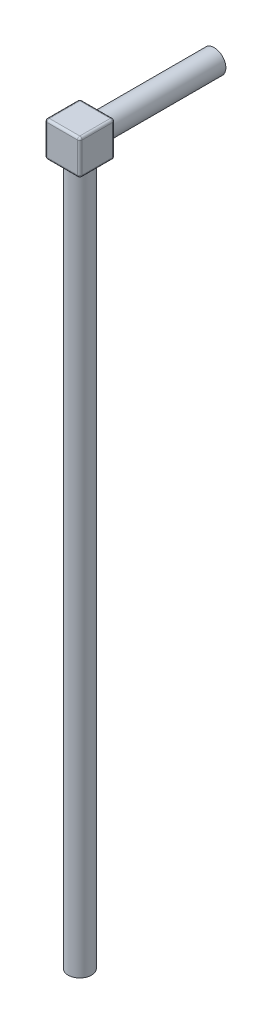
ISO-10303-21;
HEADER;
FILE_DESCRIPTION(('STEP AP214'),'2;1');
FILE_NAME('part.step','',(''),(''),'','','');
FILE_SCHEMA(('AUTOMOTIVE_DESIGN { 1 0 10303 214 1 1 1 1 }'));
ENDSEC;
DATA;
#1=APPLICATION_CONTEXT('core data for automotive mechanical design processes');
#2=APPLICATION_PROTOCOL_DEFINITION('international standard','automotive_design',2000,#1);
#3=PRODUCT_CONTEXT('',#1,'mechanical');
#4=PRODUCT('Part','Part','',(#3));
#5=PRODUCT_RELATED_PRODUCT_CATEGORY('part','',(#4));
#6=PRODUCT_DEFINITION_FORMATION('','',#4);
#7=PRODUCT_DEFINITION_CONTEXT('part definition',#1,'design');
#8=PRODUCT_DEFINITION('design','',#6,#7);
#9=PRODUCT_DEFINITION_SHAPE('','',#8);
#10=(LENGTH_UNIT() NAMED_UNIT(*) SI_UNIT(.MILLI.,.METRE.));
#11=(NAMED_UNIT(*) PLANE_ANGLE_UNIT() SI_UNIT($,.RADIAN.));
#12=(NAMED_UNIT(*) SI_UNIT($,.STERADIAN.) SOLID_ANGLE_UNIT());
#13=UNCERTAINTY_MEASURE_WITH_UNIT(LENGTH_MEASURE(1.E-05),#10,'distance_accuracy_value','');
#14=(GEOMETRIC_REPRESENTATION_CONTEXT(3) GLOBAL_UNCERTAINTY_ASSIGNED_CONTEXT((#13)) GLOBAL_UNIT_ASSIGNED_CONTEXT((#10,
#11,#12)) REPRESENTATION_CONTEXT('',''));
#15=CARTESIAN_POINT('',(0.,0.,0.));
#16=DIRECTION('',(0.,0.,1.));
#17=DIRECTION('',(1.,0.,0.));
#18=AXIS2_PLACEMENT_3D('',#15,#16,#17);
#19=CARTESIAN_POINT('',(7.5,7.5,-7.5));
#20=DIRECTION('',(-1.,0.,0.));
#21=DIRECTION('',(0.,0.,1.));
#22=AXIS2_PLACEMENT_3D('',#19,#20,#21);
#23=PLANE('',#22);
#24=DIRECTION('',(0.,0.,-1.));
#25=VECTOR('',#24,1.);
#26=CARTESIAN_POINT('',(7.5,6.5,7.5));
#27=LINE('',#26,#25);
#28=CARTESIAN_POINT('',(7.5,6.5,-6.5));
#29=VERTEX_POINT('',#28);
#30=CARTESIAN_POINT('',(7.5,6.5,6.5));
#31=VERTEX_POINT('',#30);
#32=EDGE_CURVE('E44',#29,#31,#27,.F.);
#33=ORIENTED_EDGE('',*,*,#32,.T.);
#34=DIRECTION('',(0.,-1.,0.));
#35=VECTOR('',#34,1.);
#36=CARTESIAN_POINT('',(7.5,7.5,6.5));
#37=LINE('',#36,#35);
#38=CARTESIAN_POINT('',(7.5,-6.5,6.5));
#39=VERTEX_POINT('',#38);
#40=EDGE_CURVE('E11',#31,#39,#37,.T.);
#41=ORIENTED_EDGE('',*,*,#40,.T.);
#42=DIRECTION('',(0.,0.,-1.));
#43=VECTOR('',#42,1.);
#44=CARTESIAN_POINT('',(7.5,-6.5,-7.5));
#45=LINE('',#44,#43);
#46=CARTESIAN_POINT('',(7.5,-6.5,-6.5));
#47=VERTEX_POINT('',#46);
#48=EDGE_CURVE('E210',#39,#47,#45,.T.);
#49=ORIENTED_EDGE('',*,*,#48,.T.);
#50=DIRECTION('',(0.,-1.,0.));
#51=VECTOR('',#50,1.);
#52=CARTESIAN_POINT('',(7.5,7.5,-6.5));
#53=LINE('',#52,#51);
#54=EDGE_CURVE('E55',#47,#29,#53,.F.);
#55=ORIENTED_EDGE('',*,*,#54,.T.);
#56=EDGE_LOOP('',(#33,#41,#49,#55));
#57=FACE_BOUND('',#56,.T.);
#58=ADVANCED_FACE('F35',(#57),#23,.F.);
#59=CARTESIAN_POINT('',(-7.5,7.5,-7.5));
#60=DIRECTION('',(0.,0.,1.));
#61=DIRECTION('',(1.,0.,0.));
#62=AXIS2_PLACEMENT_3D('',#59,#60,#61);
#63=PLANE('',#62);
#64=DIRECTION('',(0.,-1.,0.));
#65=VECTOR('',#64,1.);
#66=CARTESIAN_POINT('',(6.5,7.5,-7.5));
#67=LINE('',#66,#65);
#68=CARTESIAN_POINT('',(6.5,6.5,-7.5));
#69=VERTEX_POINT('',#68);
#70=CARTESIAN_POINT('',(6.5,-6.5,-7.5));
#71=VERTEX_POINT('',#70);
#72=EDGE_CURVE('E128',#69,#71,#67,.T.);
#73=ORIENTED_EDGE('',*,*,#72,.T.);
#74=DIRECTION('',(-1.,0.,0.));
#75=VECTOR('',#74,1.);
#76=CARTESIAN_POINT('',(-7.5,-6.5,-7.5));
#77=LINE('',#76,#75);
#78=CARTESIAN_POINT('',(-6.5,-6.5,-7.5));
#79=VERTEX_POINT('',#78);
#80=EDGE_CURVE('E167',#71,#79,#77,.T.);
#81=ORIENTED_EDGE('',*,*,#80,.T.);
#82=DIRECTION('',(0.,-1.,0.));
#83=VECTOR('',#82,1.);
#84=CARTESIAN_POINT('',(-6.5,7.5,-7.5));
#85=LINE('',#84,#83);
#86=CARTESIAN_POINT('',(-6.5,6.5,-7.5));
#87=VERTEX_POINT('',#86);
#88=EDGE_CURVE('E131',#79,#87,#85,.F.);
#89=ORIENTED_EDGE('',*,*,#88,.T.);
#90=DIRECTION('',(-1.,0.,0.));
#91=VECTOR('',#90,1.);
#92=CARTESIAN_POINT('',(7.5,6.5,-7.5));
#93=LINE('',#92,#91);
#94=EDGE_CURVE('E122',#87,#69,#93,.F.);
#95=ORIENTED_EDGE('',*,*,#94,.T.);
#96=EDGE_LOOP('',(#73,#81,#89,#95));
#97=FACE_BOUND('',#96,.T.);
#98=CARTESIAN_POINT('',(0.,0.,-7.5));
#99=DIRECTION('',(0.,0.,1.));
#100=DIRECTION('',(1.,0.,0.));
#101=AXIS2_PLACEMENT_3D('',#98,#99,#100);
#102=CIRCLE('',#101,5.);
#103=CARTESIAN_POINT('',(5.,0.,-7.5));
#104=VERTEX_POINT('',#103);
#105=EDGE_CURVE('E159',#104,#104,#102,.F.);
#106=ORIENTED_EDGE('',*,*,#105,.F.);
#107=EDGE_LOOP('',(#106));
#108=FACE_BOUND('',#107,.T.);
#109=ADVANCED_FACE('F124',(#97,#108),#63,.F.);
#110=CARTESIAN_POINT('',(-7.5,7.5,-7.5));
#111=DIRECTION('',(1.,0.,0.));
#112=DIRECTION('',(0.,0.,-1.));
#113=AXIS2_PLACEMENT_3D('',#110,#111,#112);
#114=PLANE('',#113);
#115=DIRECTION('',(0.,-1.,0.));
#116=VECTOR('',#115,1.);
#117=CARTESIAN_POINT('',(-7.5,7.5,-6.5));
#118=LINE('',#117,#116);
#119=CARTESIAN_POINT('',(-7.5,6.5,-6.5));
#120=VERTEX_POINT('',#119);
#121=CARTESIAN_POINT('',(-7.5,-6.5,-6.5));
#122=VERTEX_POINT('',#121);
#123=EDGE_CURVE('E197',#120,#122,#118,.T.);
#124=ORIENTED_EDGE('',*,*,#123,.T.);
#125=DIRECTION('',(0.,0.,1.));
#126=VECTOR('',#125,1.);
#127=CARTESIAN_POINT('',(-7.5,-6.5,-7.5));
#128=LINE('',#127,#126);
#129=CARTESIAN_POINT('',(-7.5,-6.5,6.5));
#130=VERTEX_POINT('',#129);
#131=EDGE_CURVE('E200',#122,#130,#128,.T.);
#132=ORIENTED_EDGE('',*,*,#131,.T.);
#133=DIRECTION('',(0.,-1.,0.));
#134=VECTOR('',#133,1.);
#135=CARTESIAN_POINT('',(-7.5,7.5,6.5));
#136=LINE('',#135,#134);
#137=CARTESIAN_POINT('',(-7.5,6.5,6.5));
#138=VERTEX_POINT('',#137);
#139=EDGE_CURVE('E195',#130,#138,#136,.F.);
#140=ORIENTED_EDGE('',*,*,#139,.T.);
#141=DIRECTION('',(0.,0.,1.));
#142=VECTOR('',#141,1.);
#143=CARTESIAN_POINT('',(-7.5,6.5,-7.5));
#144=LINE('',#143,#142);
#145=EDGE_CURVE('E193',#138,#120,#144,.F.);
#146=ORIENTED_EDGE('',*,*,#145,.T.);
#147=EDGE_LOOP('',(#124,#132,#140,#146));
#148=FACE_BOUND('',#147,.T.);
#149=ADVANCED_FACE('F288',(#148),#114,.F.);
#150=CARTESIAN_POINT('',(-7.5,7.5,7.5));
#151=DIRECTION('',(0.,0.,-1.));
#152=DIRECTION('',(-1.,0.,0.));
#153=AXIS2_PLACEMENT_3D('',#150,#151,#152);
#154=PLANE('',#153);
#155=DIRECTION('',(0.,-1.,0.));
#156=VECTOR('',#155,1.);
#157=CARTESIAN_POINT('',(-6.5,7.5,7.5));
#158=LINE('',#157,#156);
#159=CARTESIAN_POINT('',(-6.5,6.5,7.5));
#160=VERTEX_POINT('',#159);
#161=CARTESIAN_POINT('',(-6.5,-6.5,7.5));
#162=VERTEX_POINT('',#161);
#163=EDGE_CURVE('E185',#160,#162,#158,.T.);
#164=ORIENTED_EDGE('',*,*,#163,.T.);
#165=DIRECTION('',(1.,0.,0.));
#166=VECTOR('',#165,1.);
#167=CARTESIAN_POINT('',(-7.5,-6.5,7.5));
#168=LINE('',#167,#166);
#169=CARTESIAN_POINT('',(6.5,-6.5,7.5));
#170=VERTEX_POINT('',#169);
#171=EDGE_CURVE('E187',#162,#170,#168,.T.);
#172=ORIENTED_EDGE('',*,*,#171,.T.);
#173=DIRECTION('',(0.,-1.,0.));
#174=VECTOR('',#173,1.);
#175=CARTESIAN_POINT('',(6.5,7.5,7.5));
#176=LINE('',#175,#174);
#177=CARTESIAN_POINT('',(6.5,6.5,7.5));
#178=VERTEX_POINT('',#177);
#179=EDGE_CURVE('E181',#170,#178,#176,.F.);
#180=ORIENTED_EDGE('',*,*,#179,.T.);
#181=DIRECTION('',(1.,0.,0.));
#182=VECTOR('',#181,1.);
#183=CARTESIAN_POINT('',(-7.5,6.5,7.5));
#184=LINE('',#183,#182);
#185=EDGE_CURVE('E183',#178,#160,#184,.F.);
#186=ORIENTED_EDGE('',*,*,#185,.T.);
#187=EDGE_LOOP('',(#164,#172,#180,#186));
#188=FACE_BOUND('',#187,.T.);
#189=ADVANCED_FACE('F294',(#188),#154,.F.);
#190=CARTESIAN_POINT('',(0.,7.5,0.));
#191=DIRECTION('',(0.,1.,0.));
#192=DIRECTION('',(0.,0.,1.));
#193=AXIS2_PLACEMENT_3D('',#190,#191,#192);
#194=PLANE('',#193);
#195=DIRECTION('',(0.,0.,1.));
#196=VECTOR('',#195,1.);
#197=CARTESIAN_POINT('',(-6.5,7.5,7.5));
#198=LINE('',#197,#196);
#199=CARTESIAN_POINT('',(-6.5,7.5,-6.5));
#200=VERTEX_POINT('',#199);
#201=CARTESIAN_POINT('',(-6.5,7.5,6.5));
#202=VERTEX_POINT('',#201);
#203=EDGE_CURVE('E205',#200,#202,#198,.T.);
#204=ORIENTED_EDGE('',*,*,#203,.T.);
#205=DIRECTION('',(1.,0.,0.));
#206=VECTOR('',#205,1.);
#207=CARTESIAN_POINT('',(7.5,7.5,6.5));
#208=LINE('',#207,#206);
#209=CARTESIAN_POINT('',(6.5,7.5,6.5));
#210=VERTEX_POINT('',#209);
#211=EDGE_CURVE('E207',#202,#210,#208,.T.);
#212=ORIENTED_EDGE('',*,*,#211,.T.);
#213=DIRECTION('',(0.,0.,-1.));
#214=VECTOR('',#213,1.);
#215=CARTESIAN_POINT('',(6.5,7.5,-7.5));
#216=LINE('',#215,#214);
#217=CARTESIAN_POINT('',(6.5,7.5,-6.5));
#218=VERTEX_POINT('',#217);
#219=EDGE_CURVE('E202',#210,#218,#216,.T.);
#220=ORIENTED_EDGE('',*,*,#219,.T.);
#221=DIRECTION('',(-1.,0.,0.));
#222=VECTOR('',#221,1.);
#223=CARTESIAN_POINT('',(-7.5,7.5,-6.5));
#224=LINE('',#223,#222);
#225=EDGE_CURVE('E141',#218,#200,#224,.T.);
#226=ORIENTED_EDGE('',*,*,#225,.T.);
#227=EDGE_LOOP('',(#204,#212,#220,#226));
#228=FACE_BOUND('',#227,.T.);
#229=ADVANCED_FACE('F379',(#228),#194,.T.);
#230=CARTESIAN_POINT('',(0.,-7.5,0.));
#231=DIRECTION('',(0.,1.,0.));
#232=DIRECTION('',(0.,0.,1.));
#233=AXIS2_PLACEMENT_3D('',#230,#231,#232);
#234=PLANE('',#233);
#235=CARTESIAN_POINT('',(0.,-7.5,0.));
#236=DIRECTION('',(0.,1.,0.));
#237=DIRECTION('',(0.,0.,1.));
#238=AXIS2_PLACEMENT_3D('',#235,#236,#237);
#239=CIRCLE('',#238,6.);
#240=CARTESIAN_POINT('',(0.,-7.5,6.));
#241=VERTEX_POINT('',#240);
#242=EDGE_CURVE('E178',#241,#241,#239,.T.);
#243=ORIENTED_EDGE('',*,*,#242,.T.);
#244=EDGE_LOOP('',(#243));
#245=FACE_BOUND('',#244,.T.);
#246=DIRECTION('',(1.,0.,0.));
#247=VECTOR('',#246,1.);
#248=CARTESIAN_POINT('',(0.,-7.5,6.5));
#249=LINE('',#248,#247);
#250=CARTESIAN_POINT('',(6.5,-7.5,6.5));
#251=VERTEX_POINT('',#250);
#252=CARTESIAN_POINT('',(-6.5,-7.5,6.5));
#253=VERTEX_POINT('',#252);
#254=EDGE_CURVE('E171',#251,#253,#249,.F.);
#255=ORIENTED_EDGE('',*,*,#254,.T.);
#256=DIRECTION('',(0.,0.,1.));
#257=VECTOR('',#256,1.);
#258=CARTESIAN_POINT('',(-6.5,-7.5,0.));
#259=LINE('',#258,#257);
#260=CARTESIAN_POINT('',(-6.5,-7.5,-6.5));
#261=VERTEX_POINT('',#260);
#262=EDGE_CURVE('E176',#253,#261,#259,.F.);
#263=ORIENTED_EDGE('',*,*,#262,.T.);
#264=DIRECTION('',(-1.,0.,0.));
#265=VECTOR('',#264,1.);
#266=CARTESIAN_POINT('',(0.,-7.5,-6.5));
#267=LINE('',#266,#265);
#268=CARTESIAN_POINT('',(6.5,-7.5,-6.5));
#269=VERTEX_POINT('',#268);
#270=EDGE_CURVE('E173',#261,#269,#267,.F.);
#271=ORIENTED_EDGE('',*,*,#270,.T.);
#272=DIRECTION('',(0.,0.,-1.));
#273=VECTOR('',#272,1.);
#274=CARTESIAN_POINT('',(6.5,-7.5,0.));
#275=LINE('',#274,#273);
#276=EDGE_CURVE('E169',#269,#251,#275,.F.);
#277=ORIENTED_EDGE('',*,*,#276,.T.);
#278=EDGE_LOOP('',(#255,#263,#271,#277));
#279=FACE_BOUND('',#278,.T.);
#280=ADVANCED_FACE('F284',(#245,#279),#234,.F.);
#281=CARTESIAN_POINT('',(0.,0.,-57.5));
#282=DIRECTION('',(0.,0.,1.));
#283=DIRECTION('',(1.,0.,0.));
#284=AXIS2_PLACEMENT_3D('',#281,#282,#283);
#285=CYLINDRICAL_SURFACE('',#284,5.);
#286=CARTESIAN_POINT('',(0.,0.,-57.5));
#287=DIRECTION('',(0.,0.,-1.));
#288=DIRECTION('',(-1.,0.,0.));
#289=AXIS2_PLACEMENT_3D('',#286,#287,#288);
#290=CIRCLE('',#289,5.);
#291=CARTESIAN_POINT('',(-5.,0.,-57.5));
#292=VERTEX_POINT('',#291);
#293=EDGE_CURVE('E162',#292,#292,#290,.T.);
#294=ORIENTED_EDGE('',*,*,#293,.F.);
#295=EDGE_LOOP('',(#294));
#296=FACE_BOUND('',#295,.T.);
#297=ORIENTED_EDGE('',*,*,#105,.T.);
#298=EDGE_LOOP('',(#297));
#299=FACE_BOUND('',#298,.T.);
#300=ADVANCED_FACE('F281',(#296,#299),#285,.T.);
#301=CARTESIAN_POINT('',(0.,0.,-57.5));
#302=DIRECTION('',(0.,0.,-1.));
#303=DIRECTION('',(-1.,0.,0.));
#304=AXIS2_PLACEMENT_3D('',#301,#302,#303);
#305=PLANE('',#304);
#306=ORIENTED_EDGE('',*,*,#293,.T.);
#307=EDGE_LOOP('',(#306));
#308=FACE_BOUND('',#307,.T.);
#309=ADVANCED_FACE('F279',(#308),#305,.T.);
#310=CARTESIAN_POINT('',(0.,-307.5,0.));
#311=DIRECTION('',(0.,1.,0.));
#312=DIRECTION('',(0.,0.,1.));
#313=AXIS2_PLACEMENT_3D('',#310,#311,#312);
#314=CYLINDRICAL_SURFACE('',#313,5.);
#315=CARTESIAN_POINT('',(0.,-8.50000000000001,0.));
#316=DIRECTION('',(0.,1.,0.));
#317=DIRECTION('',(0.,0.,1.));
#318=AXIS2_PLACEMENT_3D('',#315,#316,#317);
#319=CIRCLE('',#318,5.);
#320=CARTESIAN_POINT('',(0.,-8.50000000000001,5.));
#321=VERTEX_POINT('',#320);
#322=EDGE_CURVE('E190',#321,#321,#319,.F.);
#323=ORIENTED_EDGE('',*,*,#322,.T.);
#324=EDGE_LOOP('',(#323));
#325=FACE_BOUND('',#324,.T.);
#326=CARTESIAN_POINT('',(0.,-307.5,0.));
#327=DIRECTION('',(0.,-1.,0.));
#328=DIRECTION('',(0.,0.,-1.));
#329=AXIS2_PLACEMENT_3D('',#326,#327,#328);
#330=CIRCLE('',#329,5.);
#331=CARTESIAN_POINT('',(0.,-307.5,-5.));
#332=VERTEX_POINT('',#331);
#333=EDGE_CURVE('E267',#332,#332,#330,.T.);
#334=ORIENTED_EDGE('',*,*,#333,.F.);
#335=EDGE_LOOP('',(#334));
#336=FACE_BOUND('',#335,.T.);
#337=ADVANCED_FACE('F374',(#325,#336),#314,.T.);
#338=CARTESIAN_POINT('',(0.,-307.5,0.));
#339=DIRECTION('',(0.,-1.,0.));
#340=DIRECTION('',(0.,0.,-1.));
#341=AXIS2_PLACEMENT_3D('',#338,#339,#340);
#342=PLANE('',#341);
#343=ORIENTED_EDGE('',*,*,#333,.T.);
#344=EDGE_LOOP('',(#343));
#345=FACE_BOUND('',#344,.T.);
#346=ADVANCED_FACE('F369',(#345),#342,.T.);
#347=CARTESIAN_POINT('',(0.,6.5,6.5));
#348=DIRECTION('',(-1.,0.,0.));
#349=DIRECTION('',(0.,0.,1.));
#350=AXIS2_PLACEMENT_3D('',#347,#348,#349);
#351=CYLINDRICAL_SURFACE('',#350,1.);
#352=CARTESIAN_POINT('',(6.5,6.5,6.5));
#353=DIRECTION('',(1.,0.,0.));
#354=DIRECTION('',(0.,0.,-1.));
#355=AXIS2_PLACEMENT_3D('',#352,#353,#354);
#356=CIRCLE('',#355,1.);
#357=EDGE_CURVE('E39',#210,#178,#356,.T.);
#358=ORIENTED_EDGE('',*,*,#357,.F.);
#359=ORIENTED_EDGE('',*,*,#211,.F.);
#360=CARTESIAN_POINT('',(-6.5,6.5,6.5));
#361=DIRECTION('',(-1.,0.,0.));
#362=DIRECTION('',(0.,0.,1.));
#363=AXIS2_PLACEMENT_3D('',#360,#361,#362);
#364=CIRCLE('',#363,1.);
#365=EDGE_CURVE('E260',#160,#202,#364,.T.);
#366=ORIENTED_EDGE('',*,*,#365,.F.);
#367=ORIENTED_EDGE('',*,*,#185,.F.);
#368=EDGE_LOOP('',(#358,#359,#366,#367));
#369=FACE_BOUND('',#368,.T.);
#370=ADVANCED_FACE('F367',(#369),#351,.T.);
#371=CARTESIAN_POINT('',(6.5,6.5,6.5));
#372=DIRECTION('',(0.,0.,1.));
#373=DIRECTION('',(1.,0.,0.));
#374=AXIS2_PLACEMENT_3D('',#371,#372,#373);
#375=SPHERICAL_SURFACE('',#374,1.);
#376=CARTESIAN_POINT('',(6.5,6.5,6.5));
#377=DIRECTION('',(0.,0.,1.));
#378=DIRECTION('',(0.,-1.,0.));
#379=AXIS2_PLACEMENT_3D('',#376,#377,#378);
#380=CIRCLE('',#379,1.);
#381=EDGE_CURVE('E256',#210,#31,#380,.F.);
#382=ORIENTED_EDGE('',*,*,#381,.F.);
#383=ORIENTED_EDGE('',*,*,#357,.T.);
#384=CARTESIAN_POINT('',(6.5,6.5,6.5));
#385=DIRECTION('',(0.,1.,0.));
#386=DIRECTION('',(0.,0.,1.));
#387=AXIS2_PLACEMENT_3D('',#384,#385,#386);
#388=CIRCLE('',#387,1.);
#389=EDGE_CURVE('E258',#31,#178,#388,.F.);
#390=ORIENTED_EDGE('',*,*,#389,.F.);
#391=EDGE_LOOP('',(#382,#383,#390));
#392=FACE_BOUND('',#391,.T.);
#393=ADVANCED_FACE('F365',(#392),#375,.T.);
#394=CARTESIAN_POINT('',(-6.5,6.5,6.5));
#395=DIRECTION('',(0.,0.,1.));
#396=DIRECTION('',(1.,0.,0.));
#397=AXIS2_PLACEMENT_3D('',#394,#395,#396);
#398=SPHERICAL_SURFACE('',#397,1.);
#399=CARTESIAN_POINT('',(-6.5,6.5,6.5));
#400=DIRECTION('',(0.,1.,0.));
#401=DIRECTION('',(0.,0.,1.));
#402=AXIS2_PLACEMENT_3D('',#399,#400,#401);
#403=CIRCLE('',#402,1.);
#404=EDGE_CURVE('E250',#160,#138,#403,.F.);
#405=ORIENTED_EDGE('',*,*,#404,.F.);
#406=ORIENTED_EDGE('',*,*,#365,.T.);
#407=CARTESIAN_POINT('',(-6.5,6.5,6.5));
#408=DIRECTION('',(0.,0.,1.));
#409=DIRECTION('',(1.,0.,0.));
#410=AXIS2_PLACEMENT_3D('',#407,#408,#409);
#411=CIRCLE('',#410,1.);
#412=EDGE_CURVE('E253',#138,#202,#411,.F.);
#413=ORIENTED_EDGE('',*,*,#412,.F.);
#414=EDGE_LOOP('',(#405,#406,#413));
#415=FACE_BOUND('',#414,.T.);
#416=ADVANCED_FACE('F361',(#415),#398,.T.);
#417=CARTESIAN_POINT('',(6.5,7.5,6.5));
#418=DIRECTION('',(0.,-1.,0.));
#419=DIRECTION('',(0.,0.,-1.));
#420=AXIS2_PLACEMENT_3D('',#417,#418,#419);
#421=CYLINDRICAL_SURFACE('',#420,1.);
#422=ORIENTED_EDGE('',*,*,#389,.T.);
#423=ORIENTED_EDGE('',*,*,#179,.F.);
#424=CARTESIAN_POINT('',(6.5,-6.5,6.5));
#425=DIRECTION('',(0.,-1.,0.));
#426=DIRECTION('',(0.,0.,-1.));
#427=AXIS2_PLACEMENT_3D('',#424,#425,#426);
#428=CIRCLE('',#427,1.);
#429=EDGE_CURVE('E245',#39,#170,#428,.T.);
#430=ORIENTED_EDGE('',*,*,#429,.F.);
#431=ORIENTED_EDGE('',*,*,#40,.F.);
#432=EDGE_LOOP('',(#422,#423,#430,#431));
#433=FACE_BOUND('',#432,.T.);
#434=ADVANCED_FACE('F357',(#433),#421,.T.);
#435=CARTESIAN_POINT('',(6.5,6.5,0.));
#436=DIRECTION('',(0.,0.,1.));
#437=DIRECTION('',(1.,0.,0.));
#438=AXIS2_PLACEMENT_3D('',#435,#436,#437);
#439=CYLINDRICAL_SURFACE('',#438,1.);
#440=ORIENTED_EDGE('',*,*,#381,.T.);
#441=ORIENTED_EDGE('',*,*,#32,.F.);
#442=CARTESIAN_POINT('',(6.5,6.5,-6.5));
#443=DIRECTION('',(0.,0.,-1.));
#444=DIRECTION('',(-1.,0.,0.));
#445=AXIS2_PLACEMENT_3D('',#442,#443,#444);
#446=CIRCLE('',#445,1.);
#447=EDGE_CURVE('E145',#218,#29,#446,.T.);
#448=ORIENTED_EDGE('',*,*,#447,.F.);
#449=ORIENTED_EDGE('',*,*,#219,.F.);
#450=EDGE_LOOP('',(#440,#441,#448,#449));
#451=FACE_BOUND('',#450,.T.);
#452=ADVANCED_FACE('F354',(#451),#439,.T.);
#453=CARTESIAN_POINT('',(0.,6.5,-6.5));
#454=DIRECTION('',(1.,0.,0.));
#455=DIRECTION('',(0.,0.,-1.));
#456=AXIS2_PLACEMENT_3D('',#453,#454,#455);
#457=CYLINDRICAL_SURFACE('',#456,1.);
#458=CARTESIAN_POINT('',(-6.5,6.5,-6.5));
#459=DIRECTION('',(-1.,0.,0.));
#460=DIRECTION('',(0.,0.,1.));
#461=AXIS2_PLACEMENT_3D('',#458,#459,#460);
#462=CIRCLE('',#461,1.);
#463=EDGE_CURVE('E146',#200,#87,#462,.T.);
#464=ORIENTED_EDGE('',*,*,#463,.F.);
#465=ORIENTED_EDGE('',*,*,#225,.F.);
#466=CARTESIAN_POINT('',(6.5,6.5,-6.5));
#467=DIRECTION('',(1.,0.,0.));
#468=DIRECTION('',(0.,1.,0.));
#469=AXIS2_PLACEMENT_3D('',#466,#467,#468);
#470=CIRCLE('',#469,1.);
#471=EDGE_CURVE('E138',#69,#218,#470,.T.);
#472=ORIENTED_EDGE('',*,*,#471,.F.);
#473=ORIENTED_EDGE('',*,*,#94,.F.);
#474=EDGE_LOOP('',(#464,#465,#472,#473));
#475=FACE_BOUND('',#474,.T.);
#476=ADVANCED_FACE('F140',(#475),#457,.T.);
#477=CARTESIAN_POINT('',(-6.5,6.5,0.));
#478=DIRECTION('',(0.,0.,-1.));
#479=DIRECTION('',(-1.,0.,0.));
#480=AXIS2_PLACEMENT_3D('',#477,#478,#479);
#481=CYLINDRICAL_SURFACE('',#480,1.);
#482=ORIENTED_EDGE('',*,*,#412,.T.);
#483=ORIENTED_EDGE('',*,*,#203,.F.);
#484=CARTESIAN_POINT('',(-6.5,6.5,-6.5));
#485=DIRECTION('',(0.,0.,-1.));
#486=DIRECTION('',(-1.,0.,0.));
#487=AXIS2_PLACEMENT_3D('',#484,#485,#486);
#488=CIRCLE('',#487,1.);
#489=EDGE_CURVE('E240',#120,#200,#488,.T.);
#490=ORIENTED_EDGE('',*,*,#489,.F.);
#491=ORIENTED_EDGE('',*,*,#145,.F.);
#492=EDGE_LOOP('',(#482,#483,#490,#491));
#493=FACE_BOUND('',#492,.T.);
#494=ADVANCED_FACE('F347',(#493),#481,.T.);
#495=CARTESIAN_POINT('',(-6.5,7.5,6.5));
#496=DIRECTION('',(0.,-1.,0.));
#497=DIRECTION('',(0.,0.,-1.));
#498=AXIS2_PLACEMENT_3D('',#495,#496,#497);
#499=CYLINDRICAL_SURFACE('',#498,1.);
#500=ORIENTED_EDGE('',*,*,#404,.T.);
#501=ORIENTED_EDGE('',*,*,#139,.F.);
#502=CARTESIAN_POINT('',(-6.5,-6.5,6.5));
#503=DIRECTION('',(0.,-1.,0.));
#504=DIRECTION('',(0.,0.,-1.));
#505=AXIS2_PLACEMENT_3D('',#502,#503,#504);
#506=CIRCLE('',#505,1.);
#507=EDGE_CURVE('E237',#162,#130,#506,.T.);
#508=ORIENTED_EDGE('',*,*,#507,.F.);
#509=ORIENTED_EDGE('',*,*,#163,.F.);
#510=EDGE_LOOP('',(#500,#501,#508,#509));
#511=FACE_BOUND('',#510,.T.);
#512=ADVANCED_FACE('F343',(#511),#499,.T.);
#513=CARTESIAN_POINT('',(-7.5,-6.5,6.5));
#514=DIRECTION('',(1.,0.,0.));
#515=DIRECTION('',(0.,0.,-1.));
#516=AXIS2_PLACEMENT_3D('',#513,#514,#515);
#517=CYLINDRICAL_SURFACE('',#516,1.);
#518=CARTESIAN_POINT('',(6.5,-6.5,6.5));
#519=DIRECTION('',(1.,0.,0.));
#520=DIRECTION('',(0.,0.,-1.));
#521=AXIS2_PLACEMENT_3D('',#518,#519,#520);
#522=CIRCLE('',#521,1.);
#523=EDGE_CURVE('E247',#170,#251,#522,.T.);
#524=ORIENTED_EDGE('',*,*,#523,.F.);
#525=ORIENTED_EDGE('',*,*,#171,.F.);
#526=CARTESIAN_POINT('',(-6.5,-6.5,6.5));
#527=DIRECTION('',(-1.,0.,0.));
#528=DIRECTION('',(0.,0.,1.));
#529=AXIS2_PLACEMENT_3D('',#526,#527,#528);
#530=CIRCLE('',#529,1.);
#531=EDGE_CURVE('E234',#253,#162,#530,.T.);
#532=ORIENTED_EDGE('',*,*,#531,.F.);
#533=ORIENTED_EDGE('',*,*,#254,.F.);
#534=EDGE_LOOP('',(#524,#525,#532,#533));
#535=FACE_BOUND('',#534,.T.);
#536=ADVANCED_FACE('F339',(#535),#517,.T.);
#537=CARTESIAN_POINT('',(6.5,-6.5,6.5));
#538=DIRECTION('',(0.,0.,1.));
#539=DIRECTION('',(1.,0.,0.));
#540=AXIS2_PLACEMENT_3D('',#537,#538,#539);
#541=SPHERICAL_SURFACE('',#540,1.);
#542=ORIENTED_EDGE('',*,*,#429,.T.);
#543=ORIENTED_EDGE('',*,*,#523,.T.);
#544=CARTESIAN_POINT('',(6.5,-6.5,6.5));
#545=DIRECTION('',(0.,0.,1.));
#546=DIRECTION('',(1.,0.,0.));
#547=AXIS2_PLACEMENT_3D('',#544,#545,#546);
#548=CIRCLE('',#547,1.);
#549=EDGE_CURVE('E152',#39,#251,#548,.F.);
#550=ORIENTED_EDGE('',*,*,#549,.F.);
#551=EDGE_LOOP('',(#542,#543,#550));
#552=FACE_BOUND('',#551,.T.);
#553=ADVANCED_FACE('F336',(#552),#541,.T.);
#554=CARTESIAN_POINT('',(6.5,6.5,-6.5));
#555=DIRECTION('',(0.,0.,1.));
#556=DIRECTION('',(1.,0.,0.));
#557=AXIS2_PLACEMENT_3D('',#554,#555,#556);
#558=SPHERICAL_SURFACE('',#557,1.);
#559=ORIENTED_EDGE('',*,*,#471,.T.);
#560=ORIENTED_EDGE('',*,*,#447,.T.);
#561=CARTESIAN_POINT('',(6.5,6.5,-6.5));
#562=DIRECTION('',(0.,1.,0.));
#563=DIRECTION('',(0.,0.,1.));
#564=AXIS2_PLACEMENT_3D('',#561,#562,#563);
#565=CIRCLE('',#564,1.);
#566=EDGE_CURVE('E149',#69,#29,#565,.F.);
#567=ORIENTED_EDGE('',*,*,#566,.F.);
#568=EDGE_LOOP('',(#559,#560,#567));
#569=FACE_BOUND('',#568,.T.);
#570=ADVANCED_FACE('F150',(#569),#558,.T.);
#571=CARTESIAN_POINT('',(-6.5,6.5,-6.5));
#572=DIRECTION('',(0.,0.,1.));
#573=DIRECTION('',(1.,0.,0.));
#574=AXIS2_PLACEMENT_3D('',#571,#572,#573);
#575=SPHERICAL_SURFACE('',#574,1.);
#576=ORIENTED_EDGE('',*,*,#489,.T.);
#577=ORIENTED_EDGE('',*,*,#463,.T.);
#578=CARTESIAN_POINT('',(-6.5,6.5,-6.5));
#579=DIRECTION('',(0.,1.,0.));
#580=DIRECTION('',(0.,0.,1.));
#581=AXIS2_PLACEMENT_3D('',#578,#579,#580);
#582=CIRCLE('',#581,1.);
#583=EDGE_CURVE('E153',#120,#87,#582,.F.);
#584=ORIENTED_EDGE('',*,*,#583,.F.);
#585=EDGE_LOOP('',(#576,#577,#584));
#586=FACE_BOUND('',#585,.T.);
#587=ADVANCED_FACE('F329',(#586),#575,.T.);
#588=CARTESIAN_POINT('',(-6.5,-6.5,6.5));
#589=DIRECTION('',(0.,0.,1.));
#590=DIRECTION('',(1.,0.,0.));
#591=AXIS2_PLACEMENT_3D('',#588,#589,#590);
#592=SPHERICAL_SURFACE('',#591,1.);
#593=ORIENTED_EDGE('',*,*,#531,.T.);
#594=ORIENTED_EDGE('',*,*,#507,.T.);
#595=CARTESIAN_POINT('',(-6.5,-6.5,6.5));
#596=DIRECTION('',(0.,0.,1.));
#597=DIRECTION('',(1.,0.,0.));
#598=AXIS2_PLACEMENT_3D('',#595,#596,#597);
#599=CIRCLE('',#598,1.);
#600=EDGE_CURVE('E227',#253,#130,#599,.F.);
#601=ORIENTED_EDGE('',*,*,#600,.F.);
#602=EDGE_LOOP('',(#593,#594,#601));
#603=FACE_BOUND('',#602,.T.);
#604=ADVANCED_FACE('F325',(#603),#592,.T.);
#605=CARTESIAN_POINT('',(6.5,-6.5,-7.5));
#606=DIRECTION('',(0.,0.,-1.));
#607=DIRECTION('',(-1.,0.,0.));
#608=AXIS2_PLACEMENT_3D('',#605,#606,#607);
#609=CYLINDRICAL_SURFACE('',#608,1.);
#610=ORIENTED_EDGE('',*,*,#549,.T.);
#611=ORIENTED_EDGE('',*,*,#276,.F.);
#612=CARTESIAN_POINT('',(6.5,-6.5,-6.5));
#613=DIRECTION('',(0.,0.,-1.));
#614=DIRECTION('',(-1.,0.,0.));
#615=AXIS2_PLACEMENT_3D('',#612,#613,#614);
#616=CIRCLE('',#615,1.);
#617=EDGE_CURVE('E224',#47,#269,#616,.T.);
#618=ORIENTED_EDGE('',*,*,#617,.F.);
#619=ORIENTED_EDGE('',*,*,#48,.F.);
#620=EDGE_LOOP('',(#610,#611,#618,#619));
#621=FACE_BOUND('',#620,.T.);
#622=ADVANCED_FACE('F322',(#621),#609,.T.);
#623=CARTESIAN_POINT('',(6.5,7.5,-6.5));
#624=DIRECTION('',(0.,-1.,0.));
#625=DIRECTION('',(0.,0.,-1.));
#626=AXIS2_PLACEMENT_3D('',#623,#624,#625);
#627=CYLINDRICAL_SURFACE('',#626,1.);
#628=ORIENTED_EDGE('',*,*,#566,.T.);
#629=ORIENTED_EDGE('',*,*,#54,.F.);
#630=CARTESIAN_POINT('',(6.5,-6.5,-6.5));
#631=DIRECTION('',(0.,-1.,0.));
#632=DIRECTION('',(0.,0.,-1.));
#633=AXIS2_PLACEMENT_3D('',#630,#631,#632);
#634=CIRCLE('',#633,1.);
#635=EDGE_CURVE('E157',#71,#47,#634,.T.);
#636=ORIENTED_EDGE('',*,*,#635,.F.);
#637=ORIENTED_EDGE('',*,*,#72,.F.);
#638=EDGE_LOOP('',(#628,#629,#636,#637));
#639=FACE_BOUND('',#638,.T.);
#640=ADVANCED_FACE('F155',(#639),#627,.T.);
#641=CARTESIAN_POINT('',(-6.5,7.5,-6.5));
#642=DIRECTION('',(0.,-1.,0.));
#643=DIRECTION('',(0.,0.,-1.));
#644=AXIS2_PLACEMENT_3D('',#641,#642,#643);
#645=CYLINDRICAL_SURFACE('',#644,1.);
#646=ORIENTED_EDGE('',*,*,#583,.T.);
#647=ORIENTED_EDGE('',*,*,#88,.F.);
#648=CARTESIAN_POINT('',(-6.5,-6.5,-6.5));
#649=DIRECTION('',(0.,-1.,0.));
#650=DIRECTION('',(0.,0.,-1.));
#651=AXIS2_PLACEMENT_3D('',#648,#649,#650);
#652=CIRCLE('',#651,1.);
#653=EDGE_CURVE('E220',#122,#79,#652,.T.);
#654=ORIENTED_EDGE('',*,*,#653,.F.);
#655=ORIENTED_EDGE('',*,*,#123,.F.);
#656=EDGE_LOOP('',(#646,#647,#654,#655));
#657=FACE_BOUND('',#656,.T.);
#658=ADVANCED_FACE('F315',(#657),#645,.T.);
#659=CARTESIAN_POINT('',(-6.5,-6.5,-7.5));
#660=DIRECTION('',(0.,0.,1.));
#661=DIRECTION('',(1.,0.,0.));
#662=AXIS2_PLACEMENT_3D('',#659,#660,#661);
#663=CYLINDRICAL_SURFACE('',#662,1.);
#664=ORIENTED_EDGE('',*,*,#600,.T.);
#665=ORIENTED_EDGE('',*,*,#131,.F.);
#666=CARTESIAN_POINT('',(-6.5,-6.5,-6.5));
#667=DIRECTION('',(0.,0.,-1.));
#668=DIRECTION('',(-1.,0.,0.));
#669=AXIS2_PLACEMENT_3D('',#666,#667,#668);
#670=CIRCLE('',#669,1.);
#671=EDGE_CURVE('E218',#261,#122,#670,.T.);
#672=ORIENTED_EDGE('',*,*,#671,.F.);
#673=ORIENTED_EDGE('',*,*,#262,.F.);
#674=EDGE_LOOP('',(#664,#665,#672,#673));
#675=FACE_BOUND('',#674,.T.);
#676=ADVANCED_FACE('F311',(#675),#663,.T.);
#677=CARTESIAN_POINT('',(6.5,-6.5,-6.5));
#678=DIRECTION('',(0.,0.,1.));
#679=DIRECTION('',(1.,0.,0.));
#680=AXIS2_PLACEMENT_3D('',#677,#678,#679);
#681=SPHERICAL_SURFACE('',#680,1.);
#682=ORIENTED_EDGE('',*,*,#635,.T.);
#683=ORIENTED_EDGE('',*,*,#617,.T.);
#684=CARTESIAN_POINT('',(6.5,-6.5,-6.5));
#685=DIRECTION('',(1.,0.,0.));
#686=DIRECTION('',(0.,0.,-1.));
#687=AXIS2_PLACEMENT_3D('',#684,#685,#686);
#688=CIRCLE('',#687,1.);
#689=EDGE_CURVE('E216',#71,#269,#688,.F.);
#690=ORIENTED_EDGE('',*,*,#689,.F.);
#691=EDGE_LOOP('',(#682,#683,#690));
#692=FACE_BOUND('',#691,.T.);
#693=ADVANCED_FACE('F307',(#692),#681,.T.);
#694=CARTESIAN_POINT('',(-6.5,-6.5,-6.5));
#695=DIRECTION('',(0.,0.,1.));
#696=DIRECTION('',(1.,0.,0.));
#697=AXIS2_PLACEMENT_3D('',#694,#695,#696);
#698=SPHERICAL_SURFACE('',#697,1.);
#699=ORIENTED_EDGE('',*,*,#671,.T.);
#700=ORIENTED_EDGE('',*,*,#653,.T.);
#701=CARTESIAN_POINT('',(-6.5,-6.5,-6.5));
#702=DIRECTION('',(-1.,0.,0.));
#703=DIRECTION('',(0.,0.,1.));
#704=AXIS2_PLACEMENT_3D('',#701,#702,#703);
#705=CIRCLE('',#704,1.);
#706=EDGE_CURVE('E214',#261,#79,#705,.F.);
#707=ORIENTED_EDGE('',*,*,#706,.F.);
#708=EDGE_LOOP('',(#699,#700,#707));
#709=FACE_BOUND('',#708,.T.);
#710=ADVANCED_FACE('F303',(#709),#698,.T.);
#711=CARTESIAN_POINT('',(-7.5,-6.5,-6.5));
#712=DIRECTION('',(-1.,0.,0.));
#713=DIRECTION('',(0.,0.,1.));
#714=AXIS2_PLACEMENT_3D('',#711,#712,#713);
#715=CYLINDRICAL_SURFACE('',#714,1.);
#716=ORIENTED_EDGE('',*,*,#689,.T.);
#717=ORIENTED_EDGE('',*,*,#270,.F.);
#718=ORIENTED_EDGE('',*,*,#706,.T.);
#719=ORIENTED_EDGE('',*,*,#80,.F.);
#720=EDGE_LOOP('',(#716,#717,#718,#719));
#721=FACE_BOUND('',#720,.T.);
#722=ADVANCED_FACE('F300',(#721),#715,.T.);
#723=CARTESIAN_POINT('',(0.,-8.50000000000001,0.));
#724=DIRECTION('',(0.,1.,0.));
#725=DIRECTION('',(0.,0.,1.));
#726=AXIS2_PLACEMENT_3D('',#723,#724,#725);
#727=TOROIDAL_SURFACE('',#726,6.,1.);
#728=ORIENTED_EDGE('',*,*,#242,.F.);
#729=EDGE_LOOP('',(#728));
#730=FACE_BOUND('',#729,.T.);
#731=ORIENTED_EDGE('',*,*,#322,.F.);
#732=EDGE_LOOP('',(#731));
#733=FACE_BOUND('',#732,.T.);
#734=ADVANCED_FACE('F37',(#730,#733),#727,.F.);
#735=CLOSED_SHELL('',(#58,#109,#149,#189,#229,#280,#300,#309,#337,#346,#370,#393,#416,#434,#452,
#476,#494,#512,#536,#553,#570,#587,#604,#622,#640,#658,#676,#693,#710,#722,#734));
#736=MANIFOLD_SOLID_BREP('B2',#735);
#737=ADVANCED_BREP_SHAPE_REPRESENTATION('',(#18,#736),#14);
#738=SHAPE_DEFINITION_REPRESENTATION(#9,#737);
ENDSEC;
END-ISO-10303-21;
